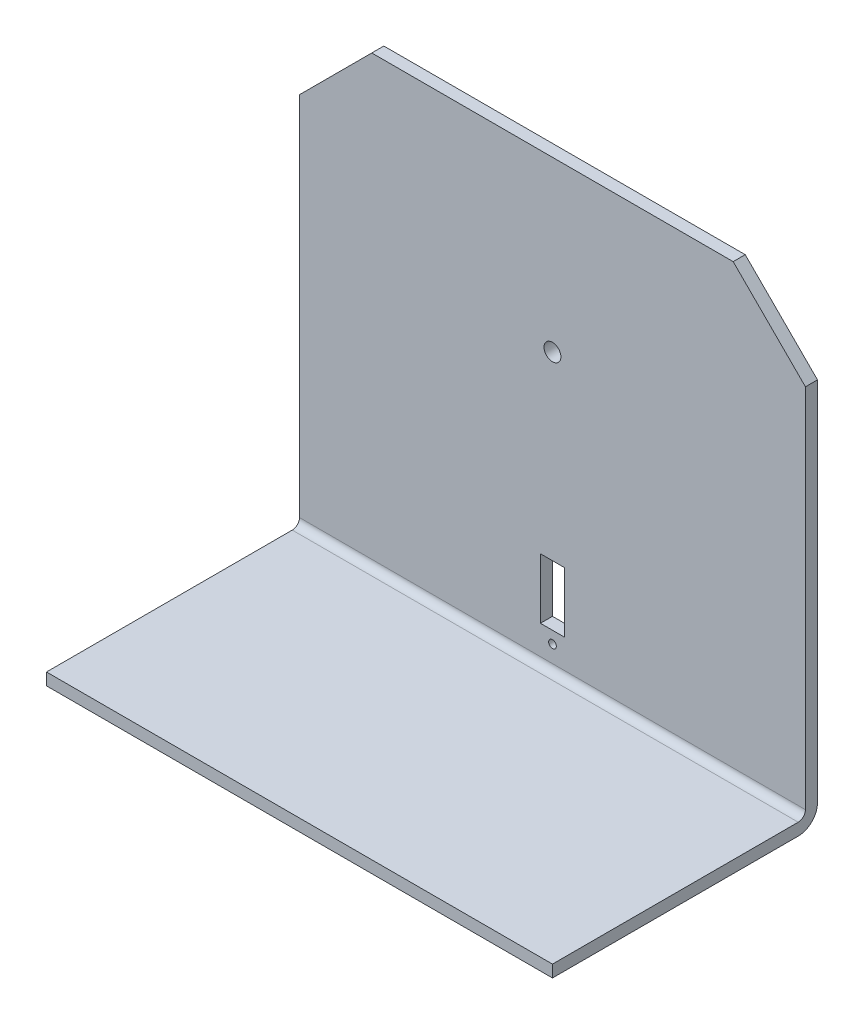
ISO-10303-21;
HEADER;
FILE_DESCRIPTION(('STEP AP214'),'2;1');
FILE_NAME('part.step','',(''),(''),'','','');
FILE_SCHEMA(('AUTOMOTIVE_DESIGN { 1 0 10303 214 1 1 1 1 }'));
ENDSEC;
DATA;
#1=APPLICATION_CONTEXT('core data for automotive mechanical design processes');
#2=APPLICATION_PROTOCOL_DEFINITION('international standard','automotive_design',2000,#1);
#3=PRODUCT_CONTEXT('',#1,'mechanical');
#4=PRODUCT('Part','Part','',(#3));
#5=PRODUCT_RELATED_PRODUCT_CATEGORY('part','',(#4));
#6=PRODUCT_DEFINITION_FORMATION('','',#4);
#7=PRODUCT_DEFINITION_CONTEXT('part definition',#1,'design');
#8=PRODUCT_DEFINITION('design','',#6,#7);
#9=PRODUCT_DEFINITION_SHAPE('','',#8);
#10=(LENGTH_UNIT() NAMED_UNIT(*) SI_UNIT(.MILLI.,.METRE.));
#11=(NAMED_UNIT(*) PLANE_ANGLE_UNIT() SI_UNIT($,.RADIAN.));
#12=(NAMED_UNIT(*) SI_UNIT($,.STERADIAN.) SOLID_ANGLE_UNIT());
#13=UNCERTAINTY_MEASURE_WITH_UNIT(LENGTH_MEASURE(1.E-05),#10,'distance_accuracy_value','');
#14=(GEOMETRIC_REPRESENTATION_CONTEXT(3) GLOBAL_UNCERTAINTY_ASSIGNED_CONTEXT((#13)) GLOBAL_UNIT_ASSIGNED_CONTEXT((#10,
#11,#12)) REPRESENTATION_CONTEXT('',''));
#15=CARTESIAN_POINT('',(0.,0.,0.));
#16=DIRECTION('',(0.,0.,1.));
#17=DIRECTION('',(1.,0.,0.));
#18=AXIS2_PLACEMENT_3D('',#15,#16,#17);
#19=CARTESIAN_POINT('',(210.,190.,4.99999999999997));
#20=DIRECTION('',(0.,-1.,0.));
#21=DIRECTION('',(0.,0.,-1.));
#22=AXIS2_PLACEMENT_3D('',#19,#20,#21);
#23=PLANE('',#22);
#24=DIRECTION('',(-1.,0.,0.));
#25=VECTOR('',#24,1.);
#26=CARTESIAN_POINT('',(210.,190.,0.));
#27=LINE('',#26,#25);
#28=CARTESIAN_POINT('',(180.,190.,0.));
#29=VERTEX_POINT('',#28);
#30=CARTESIAN_POINT('',(30.,190.,0.));
#31=VERTEX_POINT('',#30);
#32=EDGE_CURVE('E207',#29,#31,#27,.T.);
#33=ORIENTED_EDGE('',*,*,#32,.T.);
#34=DIRECTION('',(0.,0.,1.));
#35=VECTOR('',#34,1.);
#36=CARTESIAN_POINT('',(30.,190.,4.99999999999997));
#37=LINE('',#36,#35);
#38=CARTESIAN_POINT('',(30.,190.,4.99999999999997));
#39=VERTEX_POINT('',#38);
#40=EDGE_CURVE('E250',#31,#39,#37,.T.);
#41=ORIENTED_EDGE('',*,*,#40,.T.);
#42=DIRECTION('',(-1.,0.,0.));
#43=VECTOR('',#42,1.);
#44=CARTESIAN_POINT('',(210.,190.,4.99999999999997));
#45=LINE('',#44,#43);
#46=CARTESIAN_POINT('',(180.,190.,4.99999999999997));
#47=VERTEX_POINT('',#46);
#48=EDGE_CURVE('E225',#47,#39,#45,.T.);
#49=ORIENTED_EDGE('',*,*,#48,.F.);
#50=DIRECTION('',(0.,0.,-1.));
#51=VECTOR('',#50,1.);
#52=CARTESIAN_POINT('',(180.,190.,4.99999999999997));
#53=LINE('',#52,#51);
#54=EDGE_CURVE('E248',#47,#29,#53,.T.);
#55=ORIENTED_EDGE('',*,*,#54,.T.);
#56=EDGE_LOOP('',(#33,#41,#49,#55));
#57=FACE_BOUND('',#56,.T.);
#58=ADVANCED_FACE('F33',(#57),#23,.F.);
#59=CARTESIAN_POINT('',(210.,4.99999999999992,5.));
#60=DIRECTION('',(0.,0.,-1.));
#61=DIRECTION('',(0.,1.,0.));
#62=AXIS2_PLACEMENT_3D('',#59,#60,#61);
#63=PLANE('',#62);
#64=DIRECTION('',(-1.,0.,0.));
#65=VECTOR('',#64,1.);
#66=CARTESIAN_POINT('',(210.,19.9999999999999,5.));
#67=LINE('',#66,#65);
#68=CARTESIAN_POINT('',(110.,20.,5.));
#69=VERTEX_POINT('',#68);
#70=CARTESIAN_POINT('',(100.,20.,5.));
#71=VERTEX_POINT('',#70);
#72=EDGE_CURVE('E182',#69,#71,#67,.T.);
#73=ORIENTED_EDGE('',*,*,#72,.T.);
#74=DIRECTION('',(0.,1.,0.));
#75=VECTOR('',#74,1.);
#76=CARTESIAN_POINT('',(100.,4.99999999999992,5.));
#77=LINE('',#76,#75);
#78=CARTESIAN_POINT('',(100.,45.,4.99999999999999));
#79=VERTEX_POINT('',#78);
#80=EDGE_CURVE('E185',#71,#79,#77,.T.);
#81=ORIENTED_EDGE('',*,*,#80,.T.);
#82=DIRECTION('',(1.,0.,0.));
#83=VECTOR('',#82,1.);
#84=CARTESIAN_POINT('',(210.,45.,5.));
#85=LINE('',#84,#83);
#86=CARTESIAN_POINT('',(110.,45.,5.));
#87=VERTEX_POINT('',#86);
#88=EDGE_CURVE('E179',#79,#87,#85,.T.);
#89=ORIENTED_EDGE('',*,*,#88,.T.);
#90=DIRECTION('',(0.,-1.,0.));
#91=VECTOR('',#90,1.);
#92=CARTESIAN_POINT('',(110.,4.99999999999992,5.));
#93=LINE('',#92,#91);
#94=EDGE_CURVE('E146',#87,#69,#93,.T.);
#95=ORIENTED_EDGE('',*,*,#94,.T.);
#96=EDGE_LOOP('',(#73,#81,#89,#95));
#97=FACE_BOUND('',#96,.T.);
#98=CARTESIAN_POINT('',(105.,15.,5.));
#99=DIRECTION('',(0.,0.,-1.));
#100=DIRECTION('',(0.,1.,0.));
#101=AXIS2_PLACEMENT_3D('',#98,#99,#100);
#102=CIRCLE('',#101,1.6);
#103=CARTESIAN_POINT('',(105.,16.6,5.));
#104=VERTEX_POINT('',#103);
#105=EDGE_CURVE('E171',#104,#104,#102,.T.);
#106=ORIENTED_EDGE('',*,*,#105,.T.);
#107=EDGE_LOOP('',(#106));
#108=FACE_BOUND('',#107,.T.);
#109=CARTESIAN_POINT('',(105.,120.,4.99999999999998));
#110=DIRECTION('',(0.,0.,-1.));
#111=DIRECTION('',(0.,1.,0.));
#112=AXIS2_PLACEMENT_3D('',#109,#110,#111);
#113=CIRCLE('',#112,3.50000000000001);
#114=CARTESIAN_POINT('',(105.,123.5,4.99999999999998));
#115=VERTEX_POINT('',#114);
#116=EDGE_CURVE('E191',#115,#115,#113,.T.);
#117=ORIENTED_EDGE('',*,*,#116,.T.);
#118=EDGE_LOOP('',(#117));
#119=FACE_BOUND('',#118,.T.);
#120=ORIENTED_EDGE('',*,*,#48,.T.);
#121=DIRECTION('',(-0.707106781186547,-0.707106781186549,0.));
#122=VECTOR('',#121,1.);
#123=CARTESIAN_POINT('',(30.,190.,4.99999999999997));
#124=LINE('',#123,#122);
#125=CARTESIAN_POINT('',(0.,160.,4.99999999999998));
#126=VERTEX_POINT('',#125);
#127=EDGE_CURVE('E255',#39,#126,#124,.T.);
#128=ORIENTED_EDGE('',*,*,#127,.T.);
#129=DIRECTION('',(0.,-1.,0.));
#130=VECTOR('',#129,1.);
#131=CARTESIAN_POINT('',(0.,4.99999999999992,5.));
#132=LINE('',#131,#130);
#133=CARTESIAN_POINT('',(0.,7.99999999999992,5.));
#134=VERTEX_POINT('',#133);
#135=EDGE_CURVE('E194',#126,#134,#132,.T.);
#136=ORIENTED_EDGE('',*,*,#135,.T.);
#137=DIRECTION('',(-1.,0.,0.));
#138=VECTOR('',#137,1.);
#139=CARTESIAN_POINT('',(210.,7.99999999999992,5.));
#140=LINE('',#139,#138);
#141=CARTESIAN_POINT('',(210.,7.99999999999992,5.));
#142=VERTEX_POINT('',#141);
#143=EDGE_CURVE('E231',#134,#142,#140,.F.);
#144=ORIENTED_EDGE('',*,*,#143,.T.);
#145=DIRECTION('',(0.,-1.,0.));
#146=VECTOR('',#145,1.);
#147=CARTESIAN_POINT('',(210.,4.99999999999992,5.));
#148=LINE('',#147,#146);
#149=CARTESIAN_POINT('',(210.,160.,4.99999999999998));
#150=VERTEX_POINT('',#149);
#151=EDGE_CURVE('E195',#150,#142,#148,.T.);
#152=ORIENTED_EDGE('',*,*,#151,.F.);
#153=DIRECTION('',(0.707106781186549,-0.707106781186546,0.));
#154=VECTOR('',#153,1.);
#155=CARTESIAN_POINT('',(210.,160.,4.99999999999998));
#156=LINE('',#155,#154);
#157=EDGE_CURVE('E253',#150,#47,#156,.F.);
#158=ORIENTED_EDGE('',*,*,#157,.T.);
#159=EDGE_LOOP('',(#120,#128,#136,#144,#152,#158));
#160=FACE_BOUND('',#159,.T.);
#161=ADVANCED_FACE('F266',(#97,#108,#119,#160),#63,.F.);
#162=CARTESIAN_POINT('',(210.,4.99999999999999,110.));
#163=DIRECTION('',(0.,-1.,0.));
#164=DIRECTION('',(0.,0.,-1.));
#165=AXIS2_PLACEMENT_3D('',#162,#163,#164);
#166=PLANE('',#165);
#167=DIRECTION('',(0.,0.,1.));
#168=VECTOR('',#167,1.);
#169=CARTESIAN_POINT('',(210.,4.99999999999999,110.));
#170=LINE('',#169,#168);
#171=CARTESIAN_POINT('',(210.,4.99999999999992,8.00000000000001));
#172=VERTEX_POINT('',#171);
#173=CARTESIAN_POINT('',(210.,4.99999999999999,110.));
#174=VERTEX_POINT('',#173);
#175=EDGE_CURVE('E197',#172,#174,#170,.T.);
#176=ORIENTED_EDGE('',*,*,#175,.F.);
#177=DIRECTION('',(-1.,0.,0.));
#178=VECTOR('',#177,1.);
#179=CARTESIAN_POINT('',(0.,4.99999999999992,8.00000000000001));
#180=LINE('',#179,#178);
#181=CARTESIAN_POINT('',(0.,4.99999999999992,8.00000000000001));
#182=VERTEX_POINT('',#181);
#183=EDGE_CURVE('E228',#172,#182,#180,.T.);
#184=ORIENTED_EDGE('',*,*,#183,.T.);
#185=DIRECTION('',(0.,0.,1.));
#186=VECTOR('',#185,1.);
#187=CARTESIAN_POINT('',(0.,4.99999999999999,110.));
#188=LINE('',#187,#186);
#189=CARTESIAN_POINT('',(0.,4.99999999999999,110.));
#190=VERTEX_POINT('',#189);
#191=EDGE_CURVE('E209',#182,#190,#188,.T.);
#192=ORIENTED_EDGE('',*,*,#191,.T.);
#193=DIRECTION('',(-1.,0.,0.));
#194=VECTOR('',#193,1.);
#195=CARTESIAN_POINT('',(210.,4.99999999999999,110.));
#196=LINE('',#195,#194);
#197=EDGE_CURVE('E222',#174,#190,#196,.T.);
#198=ORIENTED_EDGE('',*,*,#197,.F.);
#199=EDGE_LOOP('',(#176,#184,#192,#198));
#200=FACE_BOUND('',#199,.T.);
#201=ADVANCED_FACE('F290',(#200),#166,.F.);
#202=CARTESIAN_POINT('',(210.,0.,110.));
#203=DIRECTION('',(0.,0.,-1.));
#204=DIRECTION('',(-1.,0.,0.));
#205=AXIS2_PLACEMENT_3D('',#202,#203,#204);
#206=PLANE('',#205);
#207=DIRECTION('',(0.,-1.,0.));
#208=VECTOR('',#207,1.);
#209=CARTESIAN_POINT('',(0.,0.,110.));
#210=LINE('',#209,#208);
#211=CARTESIAN_POINT('',(0.,0.,110.));
#212=VERTEX_POINT('',#211);
#213=EDGE_CURVE('E211',#190,#212,#210,.T.);
#214=ORIENTED_EDGE('',*,*,#213,.T.);
#215=DIRECTION('',(-1.,0.,0.));
#216=VECTOR('',#215,1.);
#217=CARTESIAN_POINT('',(210.,0.,110.));
#218=LINE('',#217,#216);
#219=CARTESIAN_POINT('',(210.,0.,110.));
#220=VERTEX_POINT('',#219);
#221=EDGE_CURVE('E219',#220,#212,#218,.T.);
#222=ORIENTED_EDGE('',*,*,#221,.F.);
#223=DIRECTION('',(0.,-1.,0.));
#224=VECTOR('',#223,1.);
#225=CARTESIAN_POINT('',(210.,0.,110.));
#226=LINE('',#225,#224);
#227=EDGE_CURVE('E200',#174,#220,#226,.T.);
#228=ORIENTED_EDGE('',*,*,#227,.F.);
#229=ORIENTED_EDGE('',*,*,#197,.T.);
#230=EDGE_LOOP('',(#214,#222,#228,#229));
#231=FACE_BOUND('',#230,.T.);
#232=ADVANCED_FACE('F317',(#231),#206,.F.);
#233=CARTESIAN_POINT('',(210.,0.,0.));
#234=DIRECTION('',(0.,1.,0.));
#235=DIRECTION('',(0.,0.,1.));
#236=AXIS2_PLACEMENT_3D('',#233,#234,#235);
#237=PLANE('',#236);
#238=DIRECTION('',(0.,0.,-1.));
#239=VECTOR('',#238,1.);
#240=CARTESIAN_POINT('',(0.,0.,0.));
#241=LINE('',#240,#239);
#242=CARTESIAN_POINT('',(0.,0.,8.));
#243=VERTEX_POINT('',#242);
#244=EDGE_CURVE('E213',#212,#243,#241,.T.);
#245=ORIENTED_EDGE('',*,*,#244,.T.);
#246=DIRECTION('',(-1.,0.,0.));
#247=VECTOR('',#246,1.);
#248=CARTESIAN_POINT('',(210.,0.,8.));
#249=LINE('',#248,#247);
#250=CARTESIAN_POINT('',(210.,0.,8.));
#251=VERTEX_POINT('',#250);
#252=EDGE_CURVE('E244',#243,#251,#249,.F.);
#253=ORIENTED_EDGE('',*,*,#252,.T.);
#254=DIRECTION('',(0.,0.,-1.));
#255=VECTOR('',#254,1.);
#256=CARTESIAN_POINT('',(210.,0.,0.));
#257=LINE('',#256,#255);
#258=EDGE_CURVE('E202',#220,#251,#257,.T.);
#259=ORIENTED_EDGE('',*,*,#258,.F.);
#260=ORIENTED_EDGE('',*,*,#221,.T.);
#261=EDGE_LOOP('',(#245,#253,#259,#260));
#262=FACE_BOUND('',#261,.T.);
#263=ADVANCED_FACE('F313',(#262),#237,.F.);
#264=CARTESIAN_POINT('',(210.,190.,0.));
#265=DIRECTION('',(0.,0.,1.));
#266=DIRECTION('',(0.,-1.,0.));
#267=AXIS2_PLACEMENT_3D('',#264,#265,#266);
#268=PLANE('',#267);
#269=DIRECTION('',(1.,0.,0.));
#270=VECTOR('',#269,1.);
#271=CARTESIAN_POINT('',(110.,45.,0.));
#272=LINE('',#271,#270);
#273=CARTESIAN_POINT('',(100.,45.,0.));
#274=VERTEX_POINT('',#273);
#275=CARTESIAN_POINT('',(110.,45.,0.));
#276=VERTEX_POINT('',#275);
#277=EDGE_CURVE('E154',#274,#276,#272,.T.);
#278=ORIENTED_EDGE('',*,*,#277,.F.);
#279=DIRECTION('',(0.,1.,0.));
#280=VECTOR('',#279,1.);
#281=CARTESIAN_POINT('',(100.,20.,0.));
#282=LINE('',#281,#280);
#283=CARTESIAN_POINT('',(100.,20.,0.));
#284=VERTEX_POINT('',#283);
#285=EDGE_CURVE('E159',#284,#274,#282,.T.);
#286=ORIENTED_EDGE('',*,*,#285,.F.);
#287=DIRECTION('',(-1.,0.,0.));
#288=VECTOR('',#287,1.);
#289=CARTESIAN_POINT('',(110.,20.,0.));
#290=LINE('',#289,#288);
#291=CARTESIAN_POINT('',(110.,20.,0.));
#292=VERTEX_POINT('',#291);
#293=EDGE_CURVE('E164',#292,#284,#290,.T.);
#294=ORIENTED_EDGE('',*,*,#293,.F.);
#295=DIRECTION('',(0.,-1.,0.));
#296=VECTOR('',#295,1.);
#297=CARTESIAN_POINT('',(110.,20.,0.));
#298=LINE('',#297,#296);
#299=EDGE_CURVE('E143',#276,#292,#298,.T.);
#300=ORIENTED_EDGE('',*,*,#299,.F.);
#301=EDGE_LOOP('',(#278,#286,#294,#300));
#302=FACE_BOUND('',#301,.T.);
#303=CARTESIAN_POINT('',(105.,15.,0.));
#304=DIRECTION('',(0.,0.,-1.));
#305=DIRECTION('',(0.,1.,0.));
#306=AXIS2_PLACEMENT_3D('',#303,#304,#305);
#307=CIRCLE('',#306,1.6);
#308=CARTESIAN_POINT('',(105.,16.6,0.));
#309=VERTEX_POINT('',#308);
#310=EDGE_CURVE('E174',#309,#309,#307,.T.);
#311=ORIENTED_EDGE('',*,*,#310,.F.);
#312=EDGE_LOOP('',(#311));
#313=FACE_BOUND('',#312,.T.);
#314=CARTESIAN_POINT('',(105.,120.,0.));
#315=DIRECTION('',(0.,0.,-1.));
#316=DIRECTION('',(0.,1.,0.));
#317=AXIS2_PLACEMENT_3D('',#314,#315,#316);
#318=CIRCLE('',#317,3.50000000000001);
#319=CARTESIAN_POINT('',(105.,123.5,0.));
#320=VERTEX_POINT('',#319);
#321=EDGE_CURVE('E188',#320,#320,#318,.T.);
#322=ORIENTED_EDGE('',*,*,#321,.F.);
#323=EDGE_LOOP('',(#322));
#324=FACE_BOUND('',#323,.T.);
#325=DIRECTION('',(0.,1.,0.));
#326=VECTOR('',#325,1.);
#327=CARTESIAN_POINT('',(0.,190.,0.));
#328=LINE('',#327,#326);
#329=CARTESIAN_POINT('',(0.,8.00000000000001,0.));
#330=VERTEX_POINT('',#329);
#331=CARTESIAN_POINT('',(0.,160.,0.));
#332=VERTEX_POINT('',#331);
#333=EDGE_CURVE('E198',#330,#332,#328,.T.);
#334=ORIENTED_EDGE('',*,*,#333,.T.);
#335=DIRECTION('',(0.707106781186547,0.707106781186549,0.));
#336=VECTOR('',#335,1.);
#337=CARTESIAN_POINT('',(30.,190.,0.));
#338=LINE('',#337,#336);
#339=EDGE_CURVE('E41',#332,#31,#338,.T.);
#340=ORIENTED_EDGE('',*,*,#339,.T.);
#341=ORIENTED_EDGE('',*,*,#32,.F.);
#342=DIRECTION('',(-0.707106781186549,0.707106781186546,0.));
#343=VECTOR('',#342,1.);
#344=CARTESIAN_POINT('',(210.,160.,0.));
#345=LINE('',#344,#343);
#346=CARTESIAN_POINT('',(210.,160.,0.));
#347=VERTEX_POINT('',#346);
#348=EDGE_CURVE('E48',#29,#347,#345,.F.);
#349=ORIENTED_EDGE('',*,*,#348,.T.);
#350=DIRECTION('',(0.,1.,0.));
#351=VECTOR('',#350,1.);
#352=CARTESIAN_POINT('',(210.,190.,0.));
#353=LINE('',#352,#351);
#354=CARTESIAN_POINT('',(210.,8.00000000000001,0.));
#355=VERTEX_POINT('',#354);
#356=EDGE_CURVE('E205',#355,#347,#353,.T.);
#357=ORIENTED_EDGE('',*,*,#356,.F.);
#358=DIRECTION('',(-1.,0.,0.));
#359=VECTOR('',#358,1.);
#360=CARTESIAN_POINT('',(210.,8.00000000000001,0.));
#361=LINE('',#360,#359);
#362=EDGE_CURVE('E239',#355,#330,#361,.T.);
#363=ORIENTED_EDGE('',*,*,#362,.T.);
#364=EDGE_LOOP('',(#334,#340,#341,#349,#357,#363));
#365=FACE_BOUND('',#364,.T.);
#366=ADVANCED_FACE('F161',(#302,#313,#324,#365),#268,.F.);
#367=CARTESIAN_POINT('',(210.,0.,0.));
#368=DIRECTION('',(-1.,0.,0.));
#369=DIRECTION('',(0.,0.,1.));
#370=AXIS2_PLACEMENT_3D('',#367,#368,#369);
#371=PLANE('',#370);
#372=ORIENTED_EDGE('',*,*,#356,.T.);
#373=DIRECTION('',(0.,0.,1.));
#374=VECTOR('',#373,1.);
#375=CARTESIAN_POINT('',(210.,160.,0.));
#376=LINE('',#375,#374);
#377=EDGE_CURVE('E11',#347,#150,#376,.T.);
#378=ORIENTED_EDGE('',*,*,#377,.T.);
#379=ORIENTED_EDGE('',*,*,#151,.T.);
#380=CARTESIAN_POINT('',(210.,7.99999999999992,8.00000000000001));
#381=DIRECTION('',(-1.,0.,0.));
#382=DIRECTION('',(0.,0.,1.));
#383=AXIS2_PLACEMENT_3D('',#380,#381,#382);
#384=CIRCLE('',#383,3.);
#385=EDGE_CURVE('E237',#142,#172,#384,.T.);
#386=ORIENTED_EDGE('',*,*,#385,.T.);
#387=ORIENTED_EDGE('',*,*,#175,.T.);
#388=ORIENTED_EDGE('',*,*,#227,.T.);
#389=ORIENTED_EDGE('',*,*,#258,.T.);
#390=CARTESIAN_POINT('',(210.,8.00000000000001,8.));
#391=DIRECTION('',(-1.,0.,0.));
#392=DIRECTION('',(0.,0.,1.));
#393=AXIS2_PLACEMENT_3D('',#390,#391,#392);
#394=CIRCLE('',#393,8.);
#395=EDGE_CURVE('E246',#251,#355,#394,.F.);
#396=ORIENTED_EDGE('',*,*,#395,.T.);
#397=EDGE_LOOP('',(#372,#378,#379,#386,#387,#388,#389,#396));
#398=FACE_BOUND('',#397,.T.);
#399=ADVANCED_FACE('F277',(#398),#371,.F.);
#400=CARTESIAN_POINT('',(0.,0.,0.));
#401=DIRECTION('',(-1.,0.,0.));
#402=DIRECTION('',(0.,0.,1.));
#403=AXIS2_PLACEMENT_3D('',#400,#401,#402);
#404=PLANE('',#403);
#405=ORIENTED_EDGE('',*,*,#135,.F.);
#406=DIRECTION('',(0.,0.,-1.));
#407=VECTOR('',#406,1.);
#408=CARTESIAN_POINT('',(0.,160.,0.));
#409=LINE('',#408,#407);
#410=EDGE_CURVE('E56',#126,#332,#409,.T.);
#411=ORIENTED_EDGE('',*,*,#410,.T.);
#412=ORIENTED_EDGE('',*,*,#333,.F.);
#413=CARTESIAN_POINT('',(0.,8.00000000000001,8.));
#414=DIRECTION('',(-1.,0.,0.));
#415=DIRECTION('',(0.,0.,1.));
#416=AXIS2_PLACEMENT_3D('',#413,#414,#415);
#417=CIRCLE('',#416,8.);
#418=EDGE_CURVE('E242',#330,#243,#417,.T.);
#419=ORIENTED_EDGE('',*,*,#418,.T.);
#420=ORIENTED_EDGE('',*,*,#244,.F.);
#421=ORIENTED_EDGE('',*,*,#213,.F.);
#422=ORIENTED_EDGE('',*,*,#191,.F.);
#423=CARTESIAN_POINT('',(0.,7.99999999999992,8.00000000000001));
#424=DIRECTION('',(-1.,0.,0.));
#425=DIRECTION('',(0.,0.,1.));
#426=AXIS2_PLACEMENT_3D('',#423,#424,#425);
#427=CIRCLE('',#426,3.);
#428=EDGE_CURVE('E234',#182,#134,#427,.F.);
#429=ORIENTED_EDGE('',*,*,#428,.T.);
#430=EDGE_LOOP('',(#405,#411,#412,#419,#420,#421,#422,#429));
#431=FACE_BOUND('',#430,.T.);
#432=ADVANCED_FACE('F267',(#431),#404,.T.);
#433=CARTESIAN_POINT('',(210.,7.99999999999992,8.00000000000001));
#434=DIRECTION('',(1.,0.,0.));
#435=DIRECTION('',(0.,0.,-1.));
#436=AXIS2_PLACEMENT_3D('',#433,#434,#435);
#437=CYLINDRICAL_SURFACE('',#436,3.);
#438=ORIENTED_EDGE('',*,*,#385,.F.);
#439=ORIENTED_EDGE('',*,*,#143,.F.);
#440=ORIENTED_EDGE('',*,*,#428,.F.);
#441=ORIENTED_EDGE('',*,*,#183,.F.);
#442=EDGE_LOOP('',(#438,#439,#440,#441));
#443=FACE_BOUND('',#442,.T.);
#444=ADVANCED_FACE('F274',(#443),#437,.F.);
#445=CARTESIAN_POINT('',(210.,8.00000000000001,8.));
#446=DIRECTION('',(-1.,0.,0.));
#447=DIRECTION('',(0.,0.,1.));
#448=AXIS2_PLACEMENT_3D('',#445,#446,#447);
#449=CYLINDRICAL_SURFACE('',#448,8.);
#450=ORIENTED_EDGE('',*,*,#395,.F.);
#451=ORIENTED_EDGE('',*,*,#252,.F.);
#452=ORIENTED_EDGE('',*,*,#418,.F.);
#453=ORIENTED_EDGE('',*,*,#362,.F.);
#454=EDGE_LOOP('',(#450,#451,#452,#453));
#455=FACE_BOUND('',#454,.T.);
#456=ADVANCED_FACE('F297',(#455),#449,.T.);
#457=CARTESIAN_POINT('',(105.,120.,110.));
#458=DIRECTION('',(0.,0.,-1.));
#459=DIRECTION('',(0.,1.,0.));
#460=AXIS2_PLACEMENT_3D('',#457,#458,#459);
#461=CYLINDRICAL_SURFACE('',#460,3.50000000000001);
#462=ORIENTED_EDGE('',*,*,#321,.T.);
#463=EDGE_LOOP('',(#462));
#464=FACE_BOUND('',#463,.T.);
#465=ORIENTED_EDGE('',*,*,#116,.F.);
#466=EDGE_LOOP('',(#465));
#467=FACE_BOUND('',#466,.T.);
#468=ADVANCED_FACE('F299',(#464,#467),#461,.F.);
#469=CARTESIAN_POINT('',(105.,15.,110.));
#470=DIRECTION('',(0.,0.,-1.));
#471=DIRECTION('',(0.,1.,0.));
#472=AXIS2_PLACEMENT_3D('',#469,#470,#471);
#473=CYLINDRICAL_SURFACE('',#472,1.6);
#474=ORIENTED_EDGE('',*,*,#310,.T.);
#475=EDGE_LOOP('',(#474));
#476=FACE_BOUND('',#475,.T.);
#477=ORIENTED_EDGE('',*,*,#105,.F.);
#478=EDGE_LOOP('',(#477));
#479=FACE_BOUND('',#478,.T.);
#480=ADVANCED_FACE('F304',(#476,#479),#473,.F.);
#481=CARTESIAN_POINT('',(100.,20.,110.));
#482=DIRECTION('',(-1.,0.,0.));
#483=DIRECTION('',(0.,0.,1.));
#484=AXIS2_PLACEMENT_3D('',#481,#482,#483);
#485=PLANE('',#484);
#486=DIRECTION('',(0.,0.,-1.));
#487=VECTOR('',#486,1.);
#488=CARTESIAN_POINT('',(100.,20.,110.));
#489=LINE('',#488,#487);
#490=EDGE_CURVE('E169',#71,#284,#489,.T.);
#491=ORIENTED_EDGE('',*,*,#490,.T.);
#492=ORIENTED_EDGE('',*,*,#285,.T.);
#493=DIRECTION('',(0.,0.,-1.));
#494=VECTOR('',#493,1.);
#495=CARTESIAN_POINT('',(100.,45.,110.));
#496=LINE('',#495,#494);
#497=EDGE_CURVE('E150',#79,#274,#496,.T.);
#498=ORIENTED_EDGE('',*,*,#497,.F.);
#499=ORIENTED_EDGE('',*,*,#80,.F.);
#500=EDGE_LOOP('',(#491,#492,#498,#499));
#501=FACE_BOUND('',#500,.T.);
#502=ADVANCED_FACE('F336',(#501),#485,.F.);
#503=CARTESIAN_POINT('',(110.,20.,110.));
#504=DIRECTION('',(0.,-1.,0.));
#505=DIRECTION('',(1.,0.,0.));
#506=AXIS2_PLACEMENT_3D('',#503,#504,#505);
#507=PLANE('',#506);
#508=DIRECTION('',(0.,0.,-1.));
#509=VECTOR('',#508,1.);
#510=CARTESIAN_POINT('',(110.,20.,110.));
#511=LINE('',#510,#509);
#512=EDGE_CURVE('E149',#69,#292,#511,.T.);
#513=ORIENTED_EDGE('',*,*,#512,.T.);
#514=ORIENTED_EDGE('',*,*,#293,.T.);
#515=ORIENTED_EDGE('',*,*,#490,.F.);
#516=ORIENTED_EDGE('',*,*,#72,.F.);
#517=EDGE_LOOP('',(#513,#514,#515,#516));
#518=FACE_BOUND('',#517,.T.);
#519=ADVANCED_FACE('F340',(#518),#507,.F.);
#520=CARTESIAN_POINT('',(110.,20.,110.));
#521=DIRECTION('',(1.,0.,0.));
#522=DIRECTION('',(0.,0.,-1.));
#523=AXIS2_PLACEMENT_3D('',#520,#521,#522);
#524=PLANE('',#523);
#525=DIRECTION('',(0.,0.,-1.));
#526=VECTOR('',#525,1.);
#527=CARTESIAN_POINT('',(110.,45.,110.));
#528=LINE('',#527,#526);
#529=EDGE_CURVE('E138',#87,#276,#528,.T.);
#530=ORIENTED_EDGE('',*,*,#529,.T.);
#531=ORIENTED_EDGE('',*,*,#299,.T.);
#532=ORIENTED_EDGE('',*,*,#512,.F.);
#533=ORIENTED_EDGE('',*,*,#94,.F.);
#534=EDGE_LOOP('',(#530,#531,#532,#533));
#535=FACE_BOUND('',#534,.T.);
#536=ADVANCED_FACE('F140',(#535),#524,.F.);
#537=CARTESIAN_POINT('',(110.,45.,110.));
#538=DIRECTION('',(0.,1.,0.));
#539=DIRECTION('',(0.,0.,1.));
#540=AXIS2_PLACEMENT_3D('',#537,#538,#539);
#541=PLANE('',#540);
#542=ORIENTED_EDGE('',*,*,#497,.T.);
#543=ORIENTED_EDGE('',*,*,#277,.T.);
#544=ORIENTED_EDGE('',*,*,#529,.F.);
#545=ORIENTED_EDGE('',*,*,#88,.F.);
#546=EDGE_LOOP('',(#542,#543,#544,#545));
#547=FACE_BOUND('',#546,.T.);
#548=ADVANCED_FACE('F155',(#547),#541,.F.);
#549=CARTESIAN_POINT('',(30.,190.,4.99999999999997));
#550=DIRECTION('',(-0.707106781186548,0.707106781186546,0.));
#551=DIRECTION('',(0.,0.,-1.));
#552=AXIS2_PLACEMENT_3D('',#549,#550,#551);
#553=PLANE('',#552);
#554=ORIENTED_EDGE('',*,*,#339,.F.);
#555=ORIENTED_EDGE('',*,*,#410,.F.);
#556=ORIENTED_EDGE('',*,*,#127,.F.);
#557=ORIENTED_EDGE('',*,*,#40,.F.);
#558=EDGE_LOOP('',(#554,#555,#556,#557));
#559=FACE_BOUND('',#558,.T.);
#560=ADVANCED_FACE('F264',(#559),#553,.T.);
#561=CARTESIAN_POINT('',(210.,160.,0.));
#562=DIRECTION('',(-0.707106781186546,-0.707106781186549,0.));
#563=DIRECTION('',(0.,0.,1.));
#564=AXIS2_PLACEMENT_3D('',#561,#562,#563);
#565=PLANE('',#564);
#566=ORIENTED_EDGE('',*,*,#348,.F.);
#567=ORIENTED_EDGE('',*,*,#54,.F.);
#568=ORIENTED_EDGE('',*,*,#157,.F.);
#569=ORIENTED_EDGE('',*,*,#377,.F.);
#570=EDGE_LOOP('',(#566,#567,#568,#569));
#571=FACE_BOUND('',#570,.T.);
#572=ADVANCED_FACE('F35',(#571),#565,.F.);
#573=CLOSED_SHELL('',(#58,#161,#201,#232,#263,#366,#399,#432,#444,#456,#468,#480,#502,#519,#536,
#548,#560,#572));
#574=MANIFOLD_SOLID_BREP('B2',#573);
#575=ADVANCED_BREP_SHAPE_REPRESENTATION('',(#18,#574),#14);
#576=SHAPE_DEFINITION_REPRESENTATION(#9,#575);
ENDSEC;
END-ISO-10303-21;
